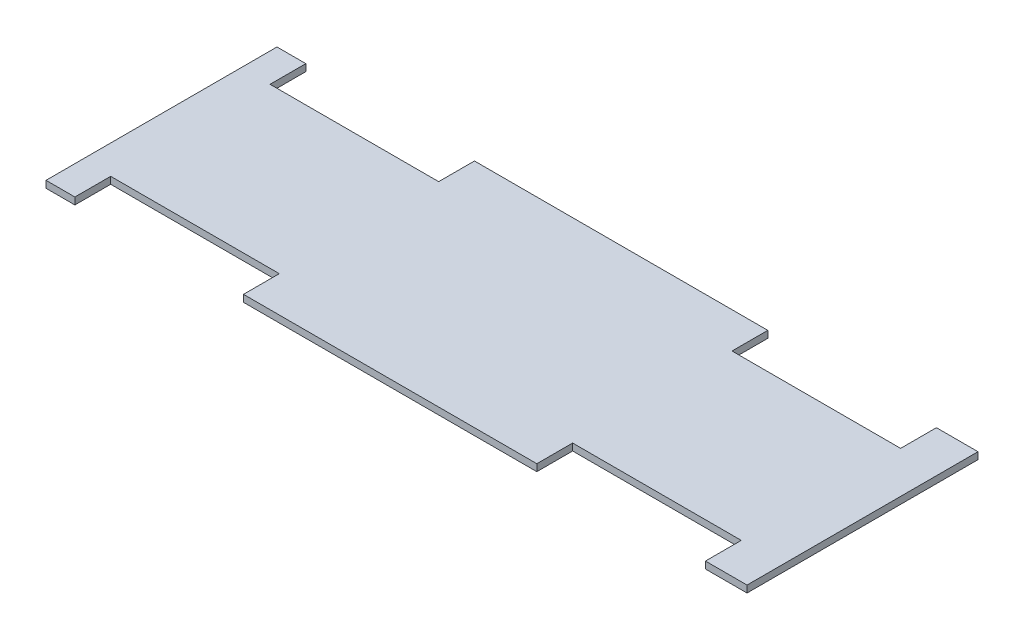
ISO-10303-21;
HEADER;
FILE_DESCRIPTION(('STEP AP214'),'2;1');
FILE_NAME('part.step','',(''),(''),'','','');
FILE_SCHEMA(('AUTOMOTIVE_DESIGN { 1 0 10303 214 1 1 1 1 }'));
ENDSEC;
DATA;
#1=APPLICATION_CONTEXT('core data for automotive mechanical design processes');
#2=APPLICATION_PROTOCOL_DEFINITION('international standard','automotive_design',2000,#1);
#3=PRODUCT_CONTEXT('',#1,'mechanical');
#4=PRODUCT('Part','Part','',(#3));
#5=PRODUCT_RELATED_PRODUCT_CATEGORY('part','',(#4));
#6=PRODUCT_DEFINITION_FORMATION('','',#4);
#7=PRODUCT_DEFINITION_CONTEXT('part definition',#1,'design');
#8=PRODUCT_DEFINITION('design','',#6,#7);
#9=PRODUCT_DEFINITION_SHAPE('','',#8);
#10=(LENGTH_UNIT() NAMED_UNIT(*) SI_UNIT(.MILLI.,.METRE.));
#11=(NAMED_UNIT(*) PLANE_ANGLE_UNIT() SI_UNIT($,.RADIAN.));
#12=(NAMED_UNIT(*) SI_UNIT($,.STERADIAN.) SOLID_ANGLE_UNIT());
#13=UNCERTAINTY_MEASURE_WITH_UNIT(LENGTH_MEASURE(1.E-05),#10,'distance_accuracy_value','');
#14=(GEOMETRIC_REPRESENTATION_CONTEXT(3) GLOBAL_UNCERTAINTY_ASSIGNED_CONTEXT((#13)) GLOBAL_UNIT_ASSIGNED_CONTEXT((#10,
#11,#12)) REPRESENTATION_CONTEXT('',''));
#15=CARTESIAN_POINT('',(0.,0.,0.));
#16=DIRECTION('',(0.,0.,1.));
#17=DIRECTION('',(1.,0.,0.));
#18=AXIS2_PLACEMENT_3D('',#15,#16,#17);
#19=CARTESIAN_POINT('',(-136.5,3.,50.));
#20=DIRECTION('',(0.,0.,-1.));
#21=DIRECTION('',(-1.,0.,0.));
#22=AXIS2_PLACEMENT_3D('',#19,#20,#21);
#23=PLANE('',#22);
#24=DIRECTION('',(1.,0.,0.));
#25=VECTOR('',#24,1.);
#26=CARTESIAN_POINT('',(-136.5,0.,50.));
#27=LINE('',#26,#25);
#28=CARTESIAN_POINT('',(-149.,0.,50.));
#29=VERTEX_POINT('',#28);
#30=CARTESIAN_POINT('',(-136.5,0.,50.));
#31=VERTEX_POINT('',#30);
#32=EDGE_CURVE('E212',#29,#31,#27,.T.);
#33=ORIENTED_EDGE('',*,*,#32,.T.);
#34=DIRECTION('',(0.,-1.,0.));
#35=VECTOR('',#34,1.);
#36=CARTESIAN_POINT('',(-136.5,3.,50.));
#37=LINE('',#36,#35);
#38=CARTESIAN_POINT('',(-136.5,3.,50.));
#39=VERTEX_POINT('',#38);
#40=EDGE_CURVE('E11',#39,#31,#37,.T.);
#41=ORIENTED_EDGE('',*,*,#40,.F.);
#42=DIRECTION('',(1.,0.,0.));
#43=VECTOR('',#42,1.);
#44=CARTESIAN_POINT('',(-136.5,3.,50.));
#45=LINE('',#44,#43);
#46=CARTESIAN_POINT('',(-149.,3.,50.));
#47=VERTEX_POINT('',#46);
#48=EDGE_CURVE('E270',#47,#39,#45,.T.);
#49=ORIENTED_EDGE('',*,*,#48,.F.);
#50=DIRECTION('',(0.,-1.,0.));
#51=VECTOR('',#50,1.);
#52=CARTESIAN_POINT('',(-149.,3.,50.));
#53=LINE('',#52,#51);
#54=EDGE_CURVE('E208',#47,#29,#53,.T.);
#55=ORIENTED_EDGE('',*,*,#54,.T.);
#56=EDGE_LOOP('',(#33,#41,#49,#55));
#57=FACE_BOUND('',#56,.T.);
#58=ADVANCED_FACE('F39',(#57),#23,.F.);
#59=CARTESIAN_POINT('',(-136.5,3.,34.4999999999999));
#60=DIRECTION('',(-1.,0.,0.));
#61=DIRECTION('',(0.,0.,1.));
#62=AXIS2_PLACEMENT_3D('',#59,#60,#61);
#63=PLANE('',#62);
#64=DIRECTION('',(0.,0.,-1.));
#65=VECTOR('',#64,1.);
#66=CARTESIAN_POINT('',(-136.5,0.,34.4999999999999));
#67=LINE('',#66,#65);
#68=CARTESIAN_POINT('',(-136.5,0.,34.4999999999999));
#69=VERTEX_POINT('',#68);
#70=EDGE_CURVE('E216',#31,#69,#67,.T.);
#71=ORIENTED_EDGE('',*,*,#70,.T.);
#72=DIRECTION('',(0.,-1.,0.));
#73=VECTOR('',#72,1.);
#74=CARTESIAN_POINT('',(-136.5,3.,34.4999999999999));
#75=LINE('',#74,#73);
#76=CARTESIAN_POINT('',(-136.5,3.,34.4999999999999));
#77=VERTEX_POINT('',#76);
#78=EDGE_CURVE('E48',#77,#69,#75,.T.);
#79=ORIENTED_EDGE('',*,*,#78,.F.);
#80=DIRECTION('',(0.,0.,-1.));
#81=VECTOR('',#80,1.);
#82=CARTESIAN_POINT('',(-136.5,3.,34.4999999999999));
#83=LINE('',#82,#81);
#84=EDGE_CURVE('E135',#39,#77,#83,.T.);
#85=ORIENTED_EDGE('',*,*,#84,.F.);
#86=ORIENTED_EDGE('',*,*,#40,.T.);
#87=EDGE_LOOP('',(#71,#79,#85,#86));
#88=FACE_BOUND('',#87,.T.);
#89=ADVANCED_FACE('F420',(#88),#63,.F.);
#90=CARTESIAN_POINT('',(-63.5,3.,34.4999999999999));
#91=DIRECTION('',(0.,0.,-1.));
#92=DIRECTION('',(-1.,0.,0.));
#93=AXIS2_PLACEMENT_3D('',#90,#91,#92);
#94=PLANE('',#93);
#95=DIRECTION('',(1.,0.,0.));
#96=VECTOR('',#95,1.);
#97=CARTESIAN_POINT('',(-63.5,0.,34.4999999999999));
#98=LINE('',#97,#96);
#99=CARTESIAN_POINT('',(-63.5,0.,34.4999999999999));
#100=VERTEX_POINT('',#99);
#101=EDGE_CURVE('E219',#69,#100,#98,.T.);
#102=ORIENTED_EDGE('',*,*,#101,.T.);
#103=DIRECTION('',(0.,-1.,0.));
#104=VECTOR('',#103,1.);
#105=CARTESIAN_POINT('',(-63.5,3.,34.4999999999999));
#106=LINE('',#105,#104);
#107=CARTESIAN_POINT('',(-63.5,3.,34.4999999999999));
#108=VERTEX_POINT('',#107);
#109=EDGE_CURVE('E329',#108,#100,#106,.T.);
#110=ORIENTED_EDGE('',*,*,#109,.F.);
#111=DIRECTION('',(1.,0.,0.));
#112=VECTOR('',#111,1.);
#113=CARTESIAN_POINT('',(-63.5,3.,34.4999999999999));
#114=LINE('',#113,#112);
#115=EDGE_CURVE('E339',#77,#108,#114,.T.);
#116=ORIENTED_EDGE('',*,*,#115,.F.);
#117=ORIENTED_EDGE('',*,*,#78,.T.);
#118=EDGE_LOOP('',(#102,#110,#116,#117));
#119=FACE_BOUND('',#118,.T.);
#120=ADVANCED_FACE('F337',(#119),#94,.F.);
#121=CARTESIAN_POINT('',(-63.5,3.,50.));
#122=DIRECTION('',(1.,0.,0.));
#123=DIRECTION('',(0.,0.,-1.));
#124=AXIS2_PLACEMENT_3D('',#121,#122,#123);
#125=PLANE('',#124);
#126=DIRECTION('',(0.,0.,1.));
#127=VECTOR('',#126,1.);
#128=CARTESIAN_POINT('',(-63.5,0.,50.));
#129=LINE('',#128,#127);
#130=CARTESIAN_POINT('',(-63.5,0.,50.));
#131=VERTEX_POINT('',#130);
#132=EDGE_CURVE('E222',#100,#131,#129,.T.);
#133=ORIENTED_EDGE('',*,*,#132,.T.);
#134=DIRECTION('',(0.,-1.,0.));
#135=VECTOR('',#134,1.);
#136=CARTESIAN_POINT('',(-63.5,3.,50.));
#137=LINE('',#136,#135);
#138=CARTESIAN_POINT('',(-63.5,3.,50.));
#139=VERTEX_POINT('',#138);
#140=EDGE_CURVE('E325',#139,#131,#137,.T.);
#141=ORIENTED_EDGE('',*,*,#140,.F.);
#142=DIRECTION('',(0.,0.,1.));
#143=VECTOR('',#142,1.);
#144=CARTESIAN_POINT('',(-63.5,3.,50.));
#145=LINE('',#144,#143);
#146=EDGE_CURVE('E358',#108,#139,#145,.T.);
#147=ORIENTED_EDGE('',*,*,#146,.F.);
#148=ORIENTED_EDGE('',*,*,#109,.T.);
#149=EDGE_LOOP('',(#133,#141,#147,#148));
#150=FACE_BOUND('',#149,.T.);
#151=ADVANCED_FACE('F348',(#150),#125,.F.);
#152=CARTESIAN_POINT('',(63.5,3.,50.));
#153=DIRECTION('',(0.,0.,-1.));
#154=DIRECTION('',(-1.,0.,0.));
#155=AXIS2_PLACEMENT_3D('',#152,#153,#154);
#156=PLANE('',#155);
#157=DIRECTION('',(1.,0.,0.));
#158=VECTOR('',#157,1.);
#159=CARTESIAN_POINT('',(63.5,0.,50.));
#160=LINE('',#159,#158);
#161=CARTESIAN_POINT('',(63.5,0.,50.));
#162=VERTEX_POINT('',#161);
#163=EDGE_CURVE('E225',#131,#162,#160,.T.);
#164=ORIENTED_EDGE('',*,*,#163,.T.);
#165=DIRECTION('',(0.,-1.,0.));
#166=VECTOR('',#165,1.);
#167=CARTESIAN_POINT('',(63.5,3.,50.));
#168=LINE('',#167,#166);
#169=CARTESIAN_POINT('',(63.5,3.,50.));
#170=VERTEX_POINT('',#169);
#171=EDGE_CURVE('E321',#170,#162,#168,.T.);
#172=ORIENTED_EDGE('',*,*,#171,.F.);
#173=DIRECTION('',(1.,0.,0.));
#174=VECTOR('',#173,1.);
#175=CARTESIAN_POINT('',(63.5,3.,50.));
#176=LINE('',#175,#174);
#177=EDGE_CURVE('E354',#139,#170,#176,.T.);
#178=ORIENTED_EDGE('',*,*,#177,.F.);
#179=ORIENTED_EDGE('',*,*,#140,.T.);
#180=EDGE_LOOP('',(#164,#172,#178,#179));
#181=FACE_BOUND('',#180,.T.);
#182=ADVANCED_FACE('F352',(#181),#156,.F.);
#183=CARTESIAN_POINT('',(63.5,3.,34.4999999999999));
#184=DIRECTION('',(-1.,0.,0.));
#185=DIRECTION('',(0.,0.,1.));
#186=AXIS2_PLACEMENT_3D('',#183,#184,#185);
#187=PLANE('',#186);
#188=DIRECTION('',(0.,0.,-1.));
#189=VECTOR('',#188,1.);
#190=CARTESIAN_POINT('',(63.5,0.,34.4999999999999));
#191=LINE('',#190,#189);
#192=CARTESIAN_POINT('',(63.5,0.,34.4999999999999));
#193=VERTEX_POINT('',#192);
#194=EDGE_CURVE('E228',#162,#193,#191,.T.);
#195=ORIENTED_EDGE('',*,*,#194,.T.);
#196=DIRECTION('',(0.,-1.,0.));
#197=VECTOR('',#196,1.);
#198=CARTESIAN_POINT('',(63.5,3.,34.4999999999999));
#199=LINE('',#198,#197);
#200=CARTESIAN_POINT('',(63.5,3.,34.4999999999999));
#201=VERTEX_POINT('',#200);
#202=EDGE_CURVE('E317',#201,#193,#199,.T.);
#203=ORIENTED_EDGE('',*,*,#202,.F.);
#204=DIRECTION('',(0.,0.,-1.));
#205=VECTOR('',#204,1.);
#206=CARTESIAN_POINT('',(63.5,3.,34.4999999999999));
#207=LINE('',#206,#205);
#208=EDGE_CURVE('E357',#170,#201,#207,.T.);
#209=ORIENTED_EDGE('',*,*,#208,.F.);
#210=ORIENTED_EDGE('',*,*,#171,.T.);
#211=EDGE_LOOP('',(#195,#203,#209,#210));
#212=FACE_BOUND('',#211,.T.);
#213=ADVANCED_FACE('F433',(#212),#187,.F.);
#214=CARTESIAN_POINT('',(136.5,3.,34.4999999999999));
#215=DIRECTION('',(0.,0.,-1.));
#216=DIRECTION('',(-1.,0.,0.));
#217=AXIS2_PLACEMENT_3D('',#214,#215,#216);
#218=PLANE('',#217);
#219=DIRECTION('',(1.,0.,0.));
#220=VECTOR('',#219,1.);
#221=CARTESIAN_POINT('',(136.5,0.,34.4999999999999));
#222=LINE('',#221,#220);
#223=CARTESIAN_POINT('',(136.5,0.,34.4999999999999));
#224=VERTEX_POINT('',#223);
#225=EDGE_CURVE('E231',#193,#224,#222,.T.);
#226=ORIENTED_EDGE('',*,*,#225,.T.);
#227=DIRECTION('',(0.,-1.,0.));
#228=VECTOR('',#227,1.);
#229=CARTESIAN_POINT('',(136.5,3.,34.4999999999999));
#230=LINE('',#229,#228);
#231=CARTESIAN_POINT('',(136.5,3.,34.4999999999999));
#232=VERTEX_POINT('',#231);
#233=EDGE_CURVE('E313',#232,#224,#230,.T.);
#234=ORIENTED_EDGE('',*,*,#233,.F.);
#235=DIRECTION('',(1.,0.,0.));
#236=VECTOR('',#235,1.);
#237=CARTESIAN_POINT('',(136.5,3.,34.4999999999999));
#238=LINE('',#237,#236);
#239=EDGE_CURVE('E362',#201,#232,#238,.T.);
#240=ORIENTED_EDGE('',*,*,#239,.F.);
#241=ORIENTED_EDGE('',*,*,#202,.T.);
#242=EDGE_LOOP('',(#226,#234,#240,#241));
#243=FACE_BOUND('',#242,.T.);
#244=ADVANCED_FACE('F436',(#243),#218,.F.);
#245=CARTESIAN_POINT('',(136.5,3.,50.));
#246=DIRECTION('',(1.,0.,0.));
#247=DIRECTION('',(0.,0.,-1.));
#248=AXIS2_PLACEMENT_3D('',#245,#246,#247);
#249=PLANE('',#248);
#250=DIRECTION('',(0.,0.,1.));
#251=VECTOR('',#250,1.);
#252=CARTESIAN_POINT('',(136.5,0.,50.));
#253=LINE('',#252,#251);
#254=CARTESIAN_POINT('',(136.5,0.,50.));
#255=VERTEX_POINT('',#254);
#256=EDGE_CURVE('E234',#224,#255,#253,.T.);
#257=ORIENTED_EDGE('',*,*,#256,.T.);
#258=DIRECTION('',(0.,-1.,0.));
#259=VECTOR('',#258,1.);
#260=CARTESIAN_POINT('',(136.5,3.,50.));
#261=LINE('',#260,#259);
#262=CARTESIAN_POINT('',(136.5,3.,50.));
#263=VERTEX_POINT('',#262);
#264=EDGE_CURVE('E309',#263,#255,#261,.T.);
#265=ORIENTED_EDGE('',*,*,#264,.F.);
#266=DIRECTION('',(0.,0.,1.));
#267=VECTOR('',#266,1.);
#268=CARTESIAN_POINT('',(136.5,3.,50.));
#269=LINE('',#268,#267);
#270=EDGE_CURVE('E369',#232,#263,#269,.T.);
#271=ORIENTED_EDGE('',*,*,#270,.F.);
#272=ORIENTED_EDGE('',*,*,#233,.T.);
#273=EDGE_LOOP('',(#257,#265,#271,#272));
#274=FACE_BOUND('',#273,.T.);
#275=ADVANCED_FACE('F440',(#274),#249,.F.);
#276=CARTESIAN_POINT('',(154.5,3.,50.0000000000001));
#277=DIRECTION('',(0.,0.,-1.));
#278=DIRECTION('',(-1.,0.,0.));
#279=AXIS2_PLACEMENT_3D('',#276,#277,#278);
#280=PLANE('',#279);
#281=DIRECTION('',(1.,0.,0.));
#282=VECTOR('',#281,1.);
#283=CARTESIAN_POINT('',(154.5,0.,50.0000000000001));
#284=LINE('',#283,#282);
#285=CARTESIAN_POINT('',(154.5,0.,50.0000000000001));
#286=VERTEX_POINT('',#285);
#287=EDGE_CURVE('E237',#255,#286,#284,.T.);
#288=ORIENTED_EDGE('',*,*,#287,.T.);
#289=DIRECTION('',(0.,-1.,0.));
#290=VECTOR('',#289,1.);
#291=CARTESIAN_POINT('',(154.5,3.,50.0000000000001));
#292=LINE('',#291,#290);
#293=CARTESIAN_POINT('',(154.5,3.,50.0000000000001));
#294=VERTEX_POINT('',#293);
#295=EDGE_CURVE('E305',#294,#286,#292,.T.);
#296=ORIENTED_EDGE('',*,*,#295,.F.);
#297=DIRECTION('',(1.,0.,0.));
#298=VECTOR('',#297,1.);
#299=CARTESIAN_POINT('',(154.5,3.,50.0000000000001));
#300=LINE('',#299,#298);
#301=EDGE_CURVE('E372',#263,#294,#300,.T.);
#302=ORIENTED_EDGE('',*,*,#301,.F.);
#303=ORIENTED_EDGE('',*,*,#264,.T.);
#304=EDGE_LOOP('',(#288,#296,#302,#303));
#305=FACE_BOUND('',#304,.T.);
#306=ADVANCED_FACE('F444',(#305),#280,.F.);
#307=CARTESIAN_POINT('',(154.5,3.,-50.0000000000001));
#308=DIRECTION('',(-1.,0.,0.));
#309=DIRECTION('',(0.,0.,1.));
#310=AXIS2_PLACEMENT_3D('',#307,#308,#309);
#311=PLANE('',#310);
#312=DIRECTION('',(0.,0.,-1.));
#313=VECTOR('',#312,1.);
#314=CARTESIAN_POINT('',(154.5,0.,-50.0000000000001));
#315=LINE('',#314,#313);
#316=CARTESIAN_POINT('',(154.5,0.,-50.0000000000001));
#317=VERTEX_POINT('',#316);
#318=EDGE_CURVE('E240',#286,#317,#315,.T.);
#319=ORIENTED_EDGE('',*,*,#318,.T.);
#320=DIRECTION('',(0.,-1.,0.));
#321=VECTOR('',#320,1.);
#322=CARTESIAN_POINT('',(154.5,3.,-50.0000000000001));
#323=LINE('',#322,#321);
#324=CARTESIAN_POINT('',(154.5,3.,-50.0000000000001));
#325=VERTEX_POINT('',#324);
#326=EDGE_CURVE('E301',#325,#317,#323,.T.);
#327=ORIENTED_EDGE('',*,*,#326,.F.);
#328=DIRECTION('',(0.,0.,-1.));
#329=VECTOR('',#328,1.);
#330=CARTESIAN_POINT('',(154.5,3.,-50.0000000000001));
#331=LINE('',#330,#329);
#332=EDGE_CURVE('E375',#294,#325,#331,.T.);
#333=ORIENTED_EDGE('',*,*,#332,.F.);
#334=ORIENTED_EDGE('',*,*,#295,.T.);
#335=EDGE_LOOP('',(#319,#327,#333,#334));
#336=FACE_BOUND('',#335,.T.);
#337=ADVANCED_FACE('F448',(#336),#311,.F.);
#338=CARTESIAN_POINT('',(136.5,3.,-50.));
#339=DIRECTION('',(0.,0.,1.));
#340=DIRECTION('',(1.,0.,0.));
#341=AXIS2_PLACEMENT_3D('',#338,#339,#340);
#342=PLANE('',#341);
#343=DIRECTION('',(-1.,0.,0.));
#344=VECTOR('',#343,1.);
#345=CARTESIAN_POINT('',(136.5,0.,-50.));
#346=LINE('',#345,#344);
#347=CARTESIAN_POINT('',(136.5,0.,-50.));
#348=VERTEX_POINT('',#347);
#349=EDGE_CURVE('E243',#317,#348,#346,.T.);
#350=ORIENTED_EDGE('',*,*,#349,.T.);
#351=DIRECTION('',(0.,-1.,0.));
#352=VECTOR('',#351,1.);
#353=CARTESIAN_POINT('',(136.5,3.,-50.));
#354=LINE('',#353,#352);
#355=CARTESIAN_POINT('',(136.5,3.,-50.));
#356=VERTEX_POINT('',#355);
#357=EDGE_CURVE('E297',#356,#348,#354,.T.);
#358=ORIENTED_EDGE('',*,*,#357,.F.);
#359=DIRECTION('',(-1.,0.,0.));
#360=VECTOR('',#359,1.);
#361=CARTESIAN_POINT('',(136.5,3.,-50.));
#362=LINE('',#361,#360);
#363=EDGE_CURVE('E378',#325,#356,#362,.T.);
#364=ORIENTED_EDGE('',*,*,#363,.F.);
#365=ORIENTED_EDGE('',*,*,#326,.T.);
#366=EDGE_LOOP('',(#350,#358,#364,#365));
#367=FACE_BOUND('',#366,.T.);
#368=ADVANCED_FACE('F452',(#367),#342,.F.);
#369=CARTESIAN_POINT('',(136.5,3.,-34.4999999999999));
#370=DIRECTION('',(1.,0.,0.));
#371=DIRECTION('',(0.,0.,-1.));
#372=AXIS2_PLACEMENT_3D('',#369,#370,#371);
#373=PLANE('',#372);
#374=DIRECTION('',(0.,0.,1.));
#375=VECTOR('',#374,1.);
#376=CARTESIAN_POINT('',(136.5,0.,-34.4999999999999));
#377=LINE('',#376,#375);
#378=CARTESIAN_POINT('',(136.5,0.,-34.4999999999999));
#379=VERTEX_POINT('',#378);
#380=EDGE_CURVE('E246',#348,#379,#377,.T.);
#381=ORIENTED_EDGE('',*,*,#380,.T.);
#382=DIRECTION('',(0.,-1.,0.));
#383=VECTOR('',#382,1.);
#384=CARTESIAN_POINT('',(136.5,3.,-34.4999999999999));
#385=LINE('',#384,#383);
#386=CARTESIAN_POINT('',(136.5,3.,-34.4999999999999));
#387=VERTEX_POINT('',#386);
#388=EDGE_CURVE('E293',#387,#379,#385,.T.);
#389=ORIENTED_EDGE('',*,*,#388,.F.);
#390=DIRECTION('',(0.,0.,1.));
#391=VECTOR('',#390,1.);
#392=CARTESIAN_POINT('',(136.5,3.,-34.4999999999999));
#393=LINE('',#392,#391);
#394=EDGE_CURVE('E381',#356,#387,#393,.T.);
#395=ORIENTED_EDGE('',*,*,#394,.F.);
#396=ORIENTED_EDGE('',*,*,#357,.T.);
#397=EDGE_LOOP('',(#381,#389,#395,#396));
#398=FACE_BOUND('',#397,.T.);
#399=ADVANCED_FACE('F456',(#398),#373,.F.);
#400=CARTESIAN_POINT('',(63.5,3.,-34.4999999999999));
#401=DIRECTION('',(0.,0.,1.));
#402=DIRECTION('',(1.,0.,0.));
#403=AXIS2_PLACEMENT_3D('',#400,#401,#402);
#404=PLANE('',#403);
#405=DIRECTION('',(-1.,0.,0.));
#406=VECTOR('',#405,1.);
#407=CARTESIAN_POINT('',(63.5,0.,-34.4999999999999));
#408=LINE('',#407,#406);
#409=CARTESIAN_POINT('',(63.5,0.,-34.4999999999999));
#410=VERTEX_POINT('',#409);
#411=EDGE_CURVE('E249',#379,#410,#408,.T.);
#412=ORIENTED_EDGE('',*,*,#411,.T.);
#413=DIRECTION('',(0.,-1.,0.));
#414=VECTOR('',#413,1.);
#415=CARTESIAN_POINT('',(63.5,3.,-34.4999999999999));
#416=LINE('',#415,#414);
#417=CARTESIAN_POINT('',(63.5,3.,-34.4999999999999));
#418=VERTEX_POINT('',#417);
#419=EDGE_CURVE('E289',#418,#410,#416,.T.);
#420=ORIENTED_EDGE('',*,*,#419,.F.);
#421=DIRECTION('',(-1.,0.,0.));
#422=VECTOR('',#421,1.);
#423=CARTESIAN_POINT('',(63.5,3.,-34.4999999999999));
#424=LINE('',#423,#422);
#425=EDGE_CURVE('E384',#387,#418,#424,.T.);
#426=ORIENTED_EDGE('',*,*,#425,.F.);
#427=ORIENTED_EDGE('',*,*,#388,.T.);
#428=EDGE_LOOP('',(#412,#420,#426,#427));
#429=FACE_BOUND('',#428,.T.);
#430=ADVANCED_FACE('F460',(#429),#404,.F.);
#431=CARTESIAN_POINT('',(63.5,3.,-50.));
#432=DIRECTION('',(-1.,0.,0.));
#433=DIRECTION('',(0.,0.,1.));
#434=AXIS2_PLACEMENT_3D('',#431,#432,#433);
#435=PLANE('',#434);
#436=DIRECTION('',(0.,0.,-1.));
#437=VECTOR('',#436,1.);
#438=CARTESIAN_POINT('',(63.5,0.,-50.));
#439=LINE('',#438,#437);
#440=CARTESIAN_POINT('',(63.5,0.,-50.));
#441=VERTEX_POINT('',#440);
#442=EDGE_CURVE('E252',#410,#441,#439,.T.);
#443=ORIENTED_EDGE('',*,*,#442,.T.);
#444=DIRECTION('',(0.,-1.,0.));
#445=VECTOR('',#444,1.);
#446=CARTESIAN_POINT('',(63.5,3.,-50.));
#447=LINE('',#446,#445);
#448=CARTESIAN_POINT('',(63.5,3.,-50.));
#449=VERTEX_POINT('',#448);
#450=EDGE_CURVE('E285',#449,#441,#447,.T.);
#451=ORIENTED_EDGE('',*,*,#450,.F.);
#452=DIRECTION('',(0.,0.,-1.));
#453=VECTOR('',#452,1.);
#454=CARTESIAN_POINT('',(63.5,3.,-50.));
#455=LINE('',#454,#453);
#456=EDGE_CURVE('E387',#418,#449,#455,.T.);
#457=ORIENTED_EDGE('',*,*,#456,.F.);
#458=ORIENTED_EDGE('',*,*,#419,.T.);
#459=EDGE_LOOP('',(#443,#451,#457,#458));
#460=FACE_BOUND('',#459,.T.);
#461=ADVANCED_FACE('F464',(#460),#435,.F.);
#462=CARTESIAN_POINT('',(-63.5,3.,-50.));
#463=DIRECTION('',(0.,0.,1.));
#464=DIRECTION('',(1.,0.,0.));
#465=AXIS2_PLACEMENT_3D('',#462,#463,#464);
#466=PLANE('',#465);
#467=DIRECTION('',(-1.,0.,0.));
#468=VECTOR('',#467,1.);
#469=CARTESIAN_POINT('',(-63.5,0.,-50.));
#470=LINE('',#469,#468);
#471=CARTESIAN_POINT('',(-63.5,0.,-50.));
#472=VERTEX_POINT('',#471);
#473=EDGE_CURVE('E255',#441,#472,#470,.T.);
#474=ORIENTED_EDGE('',*,*,#473,.T.);
#475=DIRECTION('',(0.,-1.,0.));
#476=VECTOR('',#475,1.);
#477=CARTESIAN_POINT('',(-63.5,3.,-50.));
#478=LINE('',#477,#476);
#479=CARTESIAN_POINT('',(-63.5,3.,-50.));
#480=VERTEX_POINT('',#479);
#481=EDGE_CURVE('E281',#480,#472,#478,.T.);
#482=ORIENTED_EDGE('',*,*,#481,.F.);
#483=DIRECTION('',(-1.,0.,0.));
#484=VECTOR('',#483,1.);
#485=CARTESIAN_POINT('',(-63.5,3.,-50.));
#486=LINE('',#485,#484);
#487=EDGE_CURVE('E390',#449,#480,#486,.T.);
#488=ORIENTED_EDGE('',*,*,#487,.F.);
#489=ORIENTED_EDGE('',*,*,#450,.T.);
#490=EDGE_LOOP('',(#474,#482,#488,#489));
#491=FACE_BOUND('',#490,.T.);
#492=ADVANCED_FACE('F468',(#491),#466,.F.);
#493=CARTESIAN_POINT('',(-63.5,3.,-34.4999999999999));
#494=DIRECTION('',(1.,0.,0.));
#495=DIRECTION('',(0.,0.,-1.));
#496=AXIS2_PLACEMENT_3D('',#493,#494,#495);
#497=PLANE('',#496);
#498=DIRECTION('',(0.,0.,1.));
#499=VECTOR('',#498,1.);
#500=CARTESIAN_POINT('',(-63.5,0.,-34.4999999999999));
#501=LINE('',#500,#499);
#502=CARTESIAN_POINT('',(-63.5,0.,-34.4999999999999));
#503=VERTEX_POINT('',#502);
#504=EDGE_CURVE('E258',#472,#503,#501,.T.);
#505=ORIENTED_EDGE('',*,*,#504,.T.);
#506=DIRECTION('',(0.,-1.,0.));
#507=VECTOR('',#506,1.);
#508=CARTESIAN_POINT('',(-63.5,3.,-34.4999999999999));
#509=LINE('',#508,#507);
#510=CARTESIAN_POINT('',(-63.5,3.,-34.4999999999999));
#511=VERTEX_POINT('',#510);
#512=EDGE_CURVE('E277',#511,#503,#509,.T.);
#513=ORIENTED_EDGE('',*,*,#512,.F.);
#514=DIRECTION('',(0.,0.,1.));
#515=VECTOR('',#514,1.);
#516=CARTESIAN_POINT('',(-63.5,3.,-34.4999999999999));
#517=LINE('',#516,#515);
#518=EDGE_CURVE('E393',#480,#511,#517,.T.);
#519=ORIENTED_EDGE('',*,*,#518,.F.);
#520=ORIENTED_EDGE('',*,*,#481,.T.);
#521=EDGE_LOOP('',(#505,#513,#519,#520));
#522=FACE_BOUND('',#521,.T.);
#523=ADVANCED_FACE('F401',(#522),#497,.F.);
#524=CARTESIAN_POINT('',(-136.5,3.,-34.4999999999999));
#525=DIRECTION('',(0.,0.,1.));
#526=DIRECTION('',(1.,0.,0.));
#527=AXIS2_PLACEMENT_3D('',#524,#525,#526);
#528=PLANE('',#527);
#529=DIRECTION('',(-1.,0.,0.));
#530=VECTOR('',#529,1.);
#531=CARTESIAN_POINT('',(-136.5,0.,-34.4999999999999));
#532=LINE('',#531,#530);
#533=CARTESIAN_POINT('',(-136.5,0.,-34.4999999999999));
#534=VERTEX_POINT('',#533);
#535=EDGE_CURVE('E261',#503,#534,#532,.T.);
#536=ORIENTED_EDGE('',*,*,#535,.T.);
#537=DIRECTION('',(0.,-1.,0.));
#538=VECTOR('',#537,1.);
#539=CARTESIAN_POINT('',(-136.5,3.,-34.4999999999999));
#540=LINE('',#539,#538);
#541=CARTESIAN_POINT('',(-136.5,3.,-34.4999999999999));
#542=VERTEX_POINT('',#541);
#543=EDGE_CURVE('E201',#542,#534,#540,.T.);
#544=ORIENTED_EDGE('',*,*,#543,.F.);
#545=DIRECTION('',(-1.,0.,0.));
#546=VECTOR('',#545,1.);
#547=CARTESIAN_POINT('',(-136.5,3.,-34.4999999999999));
#548=LINE('',#547,#546);
#549=EDGE_CURVE('E190',#511,#542,#548,.T.);
#550=ORIENTED_EDGE('',*,*,#549,.F.);
#551=ORIENTED_EDGE('',*,*,#512,.T.);
#552=EDGE_LOOP('',(#536,#544,#550,#551));
#553=FACE_BOUND('',#552,.T.);
#554=ADVANCED_FACE('F405',(#553),#528,.F.);
#555=CARTESIAN_POINT('',(-136.5,3.,-50.));
#556=DIRECTION('',(-1.,0.,0.));
#557=DIRECTION('',(0.,0.,1.));
#558=AXIS2_PLACEMENT_3D('',#555,#556,#557);
#559=PLANE('',#558);
#560=DIRECTION('',(0.,0.,-1.));
#561=VECTOR('',#560,1.);
#562=CARTESIAN_POINT('',(-136.5,0.,-50.));
#563=LINE('',#562,#561);
#564=CARTESIAN_POINT('',(-136.5,0.,-50.));
#565=VERTEX_POINT('',#564);
#566=EDGE_CURVE('E199',#534,#565,#563,.T.);
#567=ORIENTED_EDGE('',*,*,#566,.T.);
#568=DIRECTION('',(0.,-1.,0.));
#569=VECTOR('',#568,1.);
#570=CARTESIAN_POINT('',(-136.5,3.,-50.));
#571=LINE('',#570,#569);
#572=CARTESIAN_POINT('',(-136.5,3.,-50.));
#573=VERTEX_POINT('',#572);
#574=EDGE_CURVE('E196',#573,#565,#571,.T.);
#575=ORIENTED_EDGE('',*,*,#574,.F.);
#576=DIRECTION('',(0.,0.,-1.));
#577=VECTOR('',#576,1.);
#578=CARTESIAN_POINT('',(-136.5,3.,-50.));
#579=LINE('',#578,#577);
#580=EDGE_CURVE('E184',#542,#573,#579,.T.);
#581=ORIENTED_EDGE('',*,*,#580,.F.);
#582=ORIENTED_EDGE('',*,*,#543,.T.);
#583=EDGE_LOOP('',(#567,#575,#581,#582));
#584=FACE_BOUND('',#583,.T.);
#585=ADVANCED_FACE('F197',(#584),#559,.F.);
#586=CARTESIAN_POINT('',(-149.,3.,-50.));
#587=DIRECTION('',(0.,0.,1.));
#588=DIRECTION('',(1.,0.,0.));
#589=AXIS2_PLACEMENT_3D('',#586,#587,#588);
#590=PLANE('',#589);
#591=DIRECTION('',(-1.,0.,0.));
#592=VECTOR('',#591,1.);
#593=CARTESIAN_POINT('',(-149.,0.,-50.));
#594=LINE('',#593,#592);
#595=CARTESIAN_POINT('',(-149.,0.,-50.));
#596=VERTEX_POINT('',#595);
#597=EDGE_CURVE('E121',#565,#596,#594,.T.);
#598=ORIENTED_EDGE('',*,*,#597,.T.);
#599=DIRECTION('',(0.,-1.,0.));
#600=VECTOR('',#599,1.);
#601=CARTESIAN_POINT('',(-149.,3.,-50.));
#602=LINE('',#601,#600);
#603=CARTESIAN_POINT('',(-149.,3.,-50.));
#604=VERTEX_POINT('',#603);
#605=EDGE_CURVE('E202',#604,#596,#602,.T.);
#606=ORIENTED_EDGE('',*,*,#605,.F.);
#607=DIRECTION('',(-1.,0.,0.));
#608=VECTOR('',#607,1.);
#609=CARTESIAN_POINT('',(-149.,3.,-50.));
#610=LINE('',#609,#608);
#611=EDGE_CURVE('E188',#573,#604,#610,.T.);
#612=ORIENTED_EDGE('',*,*,#611,.F.);
#613=ORIENTED_EDGE('',*,*,#574,.T.);
#614=EDGE_LOOP('',(#598,#606,#612,#613));
#615=FACE_BOUND('',#614,.T.);
#616=ADVANCED_FACE('F204',(#615),#590,.F.);
#617=CARTESIAN_POINT('',(-149.,3.,50.));
#618=DIRECTION('',(1.,0.,0.));
#619=DIRECTION('',(0.,0.,-1.));
#620=AXIS2_PLACEMENT_3D('',#617,#618,#619);
#621=PLANE('',#620);
#622=DIRECTION('',(0.,0.,1.));
#623=VECTOR('',#622,1.);
#624=CARTESIAN_POINT('',(-149.,0.,50.));
#625=LINE('',#624,#623);
#626=EDGE_CURVE('E127',#596,#29,#625,.T.);
#627=ORIENTED_EDGE('',*,*,#626,.T.);
#628=ORIENTED_EDGE('',*,*,#54,.F.);
#629=DIRECTION('',(0.,0.,1.));
#630=VECTOR('',#629,1.);
#631=CARTESIAN_POINT('',(-149.,3.,50.));
#632=LINE('',#631,#630);
#633=EDGE_CURVE('E56',#604,#47,#632,.T.);
#634=ORIENTED_EDGE('',*,*,#633,.F.);
#635=ORIENTED_EDGE('',*,*,#605,.T.);
#636=EDGE_LOOP('',(#627,#628,#634,#635));
#637=FACE_BOUND('',#636,.T.);
#638=ADVANCED_FACE('F409',(#637),#621,.F.);
#639=CARTESIAN_POINT('',(0.,3.,0.));
#640=DIRECTION('',(0.,-1.,0.));
#641=DIRECTION('',(0.,0.,-1.));
#642=AXIS2_PLACEMENT_3D('',#639,#640,#641);
#643=PLANE('',#642);
#644=ORIENTED_EDGE('',*,*,#48,.T.);
#645=ORIENTED_EDGE('',*,*,#84,.T.);
#646=ORIENTED_EDGE('',*,*,#115,.T.);
#647=ORIENTED_EDGE('',*,*,#146,.T.);
#648=ORIENTED_EDGE('',*,*,#177,.T.);
#649=ORIENTED_EDGE('',*,*,#208,.T.);
#650=ORIENTED_EDGE('',*,*,#239,.T.);
#651=ORIENTED_EDGE('',*,*,#270,.T.);
#652=ORIENTED_EDGE('',*,*,#301,.T.);
#653=ORIENTED_EDGE('',*,*,#332,.T.);
#654=ORIENTED_EDGE('',*,*,#363,.T.);
#655=ORIENTED_EDGE('',*,*,#394,.T.);
#656=ORIENTED_EDGE('',*,*,#425,.T.);
#657=ORIENTED_EDGE('',*,*,#456,.T.);
#658=ORIENTED_EDGE('',*,*,#487,.T.);
#659=ORIENTED_EDGE('',*,*,#518,.T.);
#660=ORIENTED_EDGE('',*,*,#549,.T.);
#661=ORIENTED_EDGE('',*,*,#580,.T.);
#662=ORIENTED_EDGE('',*,*,#611,.T.);
#663=ORIENTED_EDGE('',*,*,#633,.T.);
#664=EDGE_LOOP('',(#644,#645,#646,#647,#648,#649,#650,#651,#652,#653,#654,#655,#656,#657,#658,
#659,#660,#661,#662,#663));
#665=FACE_BOUND('',#664,.T.);
#666=ADVANCED_FACE('F186',(#665),#643,.F.);
#667=CARTESIAN_POINT('',(0.,0.,0.));
#668=DIRECTION('',(0.,-1.,0.));
#669=DIRECTION('',(0.,0.,-1.));
#670=AXIS2_PLACEMENT_3D('',#667,#668,#669);
#671=PLANE('',#670);
#672=ORIENTED_EDGE('',*,*,#32,.F.);
#673=ORIENTED_EDGE('',*,*,#626,.F.);
#674=ORIENTED_EDGE('',*,*,#597,.F.);
#675=ORIENTED_EDGE('',*,*,#566,.F.);
#676=ORIENTED_EDGE('',*,*,#535,.F.);
#677=ORIENTED_EDGE('',*,*,#504,.F.);
#678=ORIENTED_EDGE('',*,*,#473,.F.);
#679=ORIENTED_EDGE('',*,*,#442,.F.);
#680=ORIENTED_EDGE('',*,*,#411,.F.);
#681=ORIENTED_EDGE('',*,*,#380,.F.);
#682=ORIENTED_EDGE('',*,*,#349,.F.);
#683=ORIENTED_EDGE('',*,*,#318,.F.);
#684=ORIENTED_EDGE('',*,*,#287,.F.);
#685=ORIENTED_EDGE('',*,*,#256,.F.);
#686=ORIENTED_EDGE('',*,*,#225,.F.);
#687=ORIENTED_EDGE('',*,*,#194,.F.);
#688=ORIENTED_EDGE('',*,*,#163,.F.);
#689=ORIENTED_EDGE('',*,*,#132,.F.);
#690=ORIENTED_EDGE('',*,*,#101,.F.);
#691=ORIENTED_EDGE('',*,*,#70,.F.);
#692=EDGE_LOOP('',(#672,#673,#674,#675,#676,#677,#678,#679,#680,#681,#682,#683,#684,#685,#686,
#687,#688,#689,#690,#691));
#693=FACE_BOUND('',#692,.T.);
#694=ADVANCED_FACE('F343',(#693),#671,.T.);
#695=CLOSED_SHELL('',(#58,#89,#120,#151,#182,#213,#244,#275,#306,#337,#368,#399,#430,#461,#492,
#523,#554,#585,#616,#638,#666,#694));
#696=MANIFOLD_SOLID_BREP('B2',#695);
#697=ADVANCED_BREP_SHAPE_REPRESENTATION('',(#18,#696),#14);
#698=SHAPE_DEFINITION_REPRESENTATION(#9,#697);
ENDSEC;
END-ISO-10303-21;
